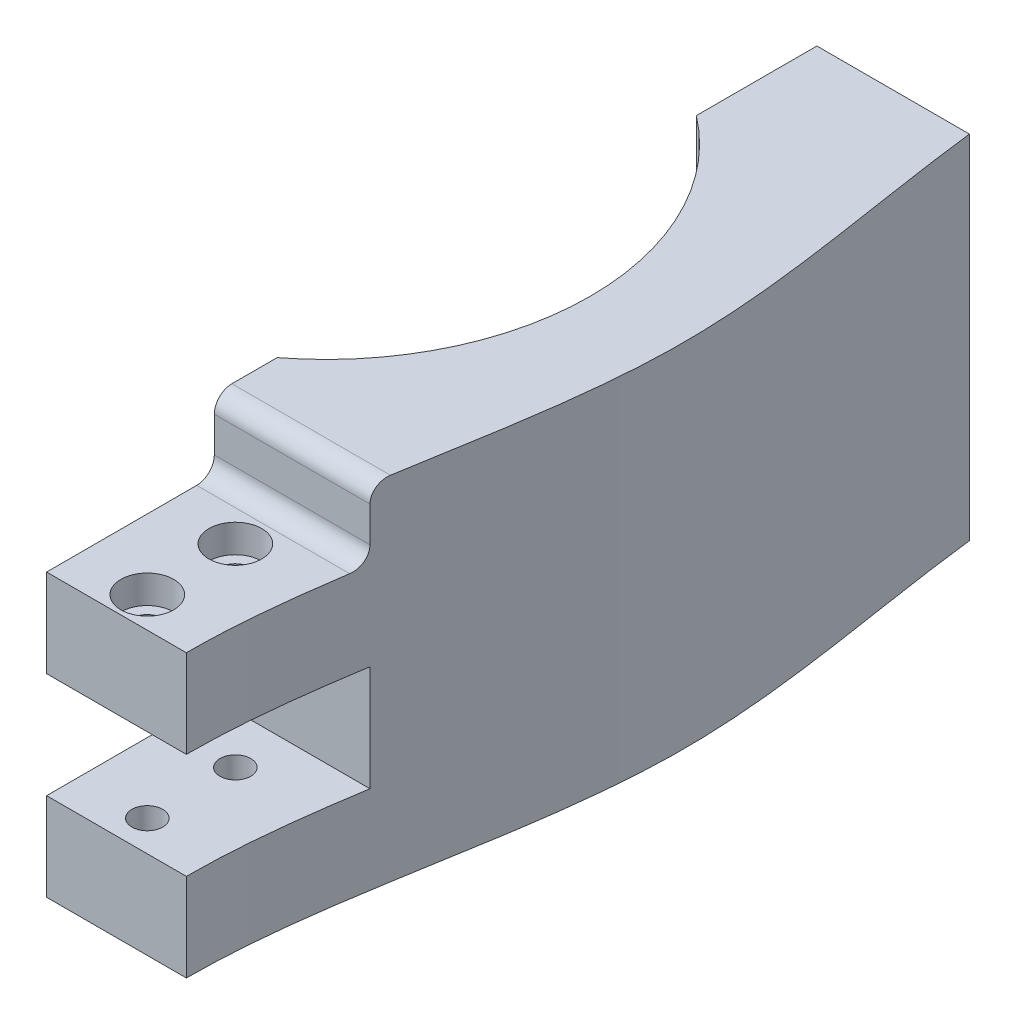
ISO-10303-21;
HEADER;
FILE_DESCRIPTION(('STEP AP214'),'2;1');
FILE_NAME('part.step','',(''),(''),'','','');
FILE_SCHEMA(('AUTOMOTIVE_DESIGN { 1 0 10303 214 1 1 1 1 }'));
ENDSEC;
DATA;
#1=APPLICATION_CONTEXT('core data for automotive mechanical design processes');
#2=APPLICATION_PROTOCOL_DEFINITION('international standard','automotive_design',2000,#1);
#3=PRODUCT_CONTEXT('',#1,'mechanical');
#4=PRODUCT('Part','Part','',(#3));
#5=PRODUCT_RELATED_PRODUCT_CATEGORY('part','',(#4));
#6=PRODUCT_DEFINITION_FORMATION('','',#4);
#7=PRODUCT_DEFINITION_CONTEXT('part definition',#1,'design');
#8=PRODUCT_DEFINITION('design','',#6,#7);
#9=PRODUCT_DEFINITION_SHAPE('','',#8);
#10=(LENGTH_UNIT() NAMED_UNIT(*) SI_UNIT(.MILLI.,.METRE.));
#11=(NAMED_UNIT(*) PLANE_ANGLE_UNIT() SI_UNIT($,.RADIAN.));
#12=(NAMED_UNIT(*) SI_UNIT($,.STERADIAN.) SOLID_ANGLE_UNIT());
#13=UNCERTAINTY_MEASURE_WITH_UNIT(LENGTH_MEASURE(1.E-05),#10,'distance_accuracy_value','');
#14=(GEOMETRIC_REPRESENTATION_CONTEXT(3) GLOBAL_UNCERTAINTY_ASSIGNED_CONTEXT((#13)) GLOBAL_UNIT_ASSIGNED_CONTEXT((#10,
#11,#12)) REPRESENTATION_CONTEXT('',''));
#15=CARTESIAN_POINT('',(0.,0.,0.));
#16=DIRECTION('',(0.,0.,1.));
#17=DIRECTION('',(1.,0.,0.));
#18=AXIS2_PLACEMENT_3D('',#15,#16,#17);
#19=CARTESIAN_POINT('',(26.1874999999999,0.,36.4999999999999));
#20=DIRECTION('',(0.,1.,0.));
#21=DIRECTION('',(0.,0.,1.));
#22=AXIS2_PLACEMENT_3D('',#19,#20,#21);
#23=CYLINDRICAL_SURFACE('',#22,1.75);
#24=CARTESIAN_POINT('',(26.1874999999999,10.,36.4999999999999));
#25=DIRECTION('',(0.,-1.,0.));
#26=DIRECTION('',(1.,0.,0.));
#27=AXIS2_PLACEMENT_3D('',#24,#25,#26);
#28=CIRCLE('',#27,1.75);
#29=CARTESIAN_POINT('',(27.9374999999999,10.,36.4999999999999));
#30=VERTEX_POINT('',#29);
#31=EDGE_CURVE('E411',#30,#30,#28,.F.);
#32=ORIENTED_EDGE('',*,*,#31,.T.);
#33=EDGE_LOOP('',(#32));
#34=FACE_BOUND('',#33,.T.);
#35=CARTESIAN_POINT('',(26.1874999999999,3.2,36.4999999999999));
#36=DIRECTION('',(0.,1.,0.));
#37=DIRECTION('',(0.,0.,-1.));
#38=AXIS2_PLACEMENT_3D('',#35,#36,#37);
#39=CIRCLE('',#38,1.75);
#40=CARTESIAN_POINT('',(26.1874999999999,3.2,34.7499999999999));
#41=VERTEX_POINT('',#40);
#42=EDGE_CURVE('E385',#41,#41,#39,.F.);
#43=ORIENTED_EDGE('',*,*,#42,.T.);
#44=EDGE_LOOP('',(#43));
#45=FACE_BOUND('',#44,.T.);
#46=ADVANCED_FACE('F46',(#34,#45),#23,.F.);
#47=CARTESIAN_POINT('',(26.1874999999999,0.,46.4999999999999));
#48=DIRECTION('',(0.,1.,0.));
#49=DIRECTION('',(0.,0.,1.));
#50=AXIS2_PLACEMENT_3D('',#47,#48,#49);
#51=CYLINDRICAL_SURFACE('',#50,1.75);
#52=CARTESIAN_POINT('',(26.1874999999999,10.,46.4999999999999));
#53=DIRECTION('',(0.,-1.,0.));
#54=DIRECTION('',(1.,0.,0.));
#55=AXIS2_PLACEMENT_3D('',#52,#53,#54);
#56=CIRCLE('',#55,1.75);
#57=CARTESIAN_POINT('',(27.9374999999999,10.,46.4999999999999));
#58=VERTEX_POINT('',#57);
#59=EDGE_CURVE('E408',#58,#58,#56,.F.);
#60=ORIENTED_EDGE('',*,*,#59,.T.);
#61=EDGE_LOOP('',(#60));
#62=FACE_BOUND('',#61,.T.);
#63=CARTESIAN_POINT('',(26.1874999999999,3.2,46.4999999999999));
#64=DIRECTION('',(0.,1.,0.));
#65=DIRECTION('',(0.,0.,-1.));
#66=AXIS2_PLACEMENT_3D('',#63,#64,#65);
#67=CIRCLE('',#66,1.75);
#68=CARTESIAN_POINT('',(26.1874999999999,3.2,44.7499999999999));
#69=VERTEX_POINT('',#68);
#70=EDGE_CURVE('E356',#69,#69,#67,.F.);
#71=ORIENTED_EDGE('',*,*,#70,.T.);
#72=EDGE_LOOP('',(#71));
#73=FACE_BOUND('',#72,.T.);
#74=ADVANCED_FACE('F510',(#62,#73),#51,.F.);
#75=CARTESIAN_POINT('',(26.1874999999999,22.,36.4999999999999));
#76=DIRECTION('',(0.,-1.,0.));
#77=DIRECTION('',(1.,0.,0.));
#78=AXIS2_PLACEMENT_3D('',#75,#76,#77);
#79=CIRCLE('',#78,1.75);
#80=CARTESIAN_POINT('',(27.9374999999999,22.,36.4999999999999));
#81=VERTEX_POINT('',#80);
#82=EDGE_CURVE('E421',#81,#81,#79,.F.);
#83=ORIENTED_EDGE('',*,*,#82,.F.);
#84=EDGE_LOOP('',(#83));
#85=FACE_BOUND('',#84,.T.);
#86=CARTESIAN_POINT('',(26.1874999999999,28.8,36.4999999999999));
#87=DIRECTION('',(0.,-1.,0.));
#88=DIRECTION('',(0.,0.,1.));
#89=AXIS2_PLACEMENT_3D('',#86,#87,#88);
#90=CIRCLE('',#89,1.75);
#91=CARTESIAN_POINT('',(26.1874999999999,28.8,38.2499999999999));
#92=VERTEX_POINT('',#91);
#93=EDGE_CURVE('E401',#92,#92,#90,.F.);
#94=ORIENTED_EDGE('',*,*,#93,.T.);
#95=EDGE_LOOP('',(#94));
#96=FACE_BOUND('',#95,.T.);
#97=ADVANCED_FACE('F513',(#85,#96),#23,.F.);
#98=CARTESIAN_POINT('',(26.1874999999999,22.,46.4999999999999));
#99=DIRECTION('',(0.,-1.,0.));
#100=DIRECTION('',(1.,0.,0.));
#101=AXIS2_PLACEMENT_3D('',#98,#99,#100);
#102=CIRCLE('',#101,1.75);
#103=CARTESIAN_POINT('',(27.9374999999999,22.,46.4999999999999));
#104=VERTEX_POINT('',#103);
#105=EDGE_CURVE('E420',#104,#104,#102,.F.);
#106=ORIENTED_EDGE('',*,*,#105,.F.);
#107=EDGE_LOOP('',(#106));
#108=FACE_BOUND('',#107,.T.);
#109=CARTESIAN_POINT('',(26.1874999999999,28.8,46.4999999999999));
#110=DIRECTION('',(0.,-1.,0.));
#111=DIRECTION('',(0.,0.,1.));
#112=AXIS2_PLACEMENT_3D('',#109,#110,#111);
#113=CIRCLE('',#112,1.75);
#114=CARTESIAN_POINT('',(26.1874999999999,28.8,48.2499999999999));
#115=VERTEX_POINT('',#114);
#116=EDGE_CURVE('E372',#115,#115,#113,.F.);
#117=ORIENTED_EDGE('',*,*,#116,.T.);
#118=EDGE_LOOP('',(#117));
#119=FACE_BOUND('',#118,.T.);
#120=ADVANCED_FACE('F519',(#108,#119),#51,.F.);
#121=CARTESIAN_POINT('',(0.,40.,49.9999999999999));
#122=DIRECTION('',(0.,0.,1.));
#123=DIRECTION('',(-1.,0.,0.));
#124=AXIS2_PLACEMENT_3D('',#121,#122,#123);
#125=PLANE('',#124);
#126=DIRECTION('',(0.,1.,0.));
#127=VECTOR('',#126,1.);
#128=CARTESIAN_POINT('',(18.2499999999999,40.,49.9999999999999));
#129=LINE('',#128,#127);
#130=CARTESIAN_POINT('',(18.2499999999999,0.,49.9999999999999));
#131=VERTEX_POINT('',#130);
#132=CARTESIAN_POINT('',(18.2499999999999,10.,49.9999999999999));
#133=VERTEX_POINT('',#132);
#134=EDGE_CURVE('E230',#131,#133,#129,.T.);
#135=ORIENTED_EDGE('',*,*,#134,.F.);
#136=DIRECTION('',(1.,0.,0.));
#137=VECTOR('',#136,1.);
#138=CARTESIAN_POINT('',(0.,0.,49.9999999999999));
#139=LINE('',#138,#137);
#140=CARTESIAN_POINT('',(34.1249999999999,0.,49.9999999999999));
#141=VERTEX_POINT('',#140);
#142=EDGE_CURVE('E313',#131,#141,#139,.T.);
#143=ORIENTED_EDGE('',*,*,#142,.T.);
#144=DIRECTION('',(0.,1.,0.));
#145=VECTOR('',#144,1.);
#146=CARTESIAN_POINT('',(34.1249999999999,0.,49.9999999999999));
#147=LINE('',#146,#145);
#148=CARTESIAN_POINT('',(34.1249999999999,10.,49.9999999999999));
#149=VERTEX_POINT('',#148);
#150=EDGE_CURVE('E286',#141,#149,#147,.T.);
#151=ORIENTED_EDGE('',*,*,#150,.T.);
#152=DIRECTION('',(1.,0.,0.));
#153=VECTOR('',#152,1.);
#154=CARTESIAN_POINT('',(0.,10.,49.9999999999999));
#155=LINE('',#154,#153);
#156=EDGE_CURVE('E389',#133,#149,#155,.T.);
#157=ORIENTED_EDGE('',*,*,#156,.F.);
#158=EDGE_LOOP('',(#135,#143,#151,#157));
#159=FACE_BOUND('',#158,.T.);
#160=ADVANCED_FACE('F490',(#159),#125,.T.);
#161=DIRECTION('',(1.,0.,0.));
#162=VECTOR('',#161,1.);
#163=CARTESIAN_POINT('',(0.,22.,49.9999999999999));
#164=LINE('',#163,#162);
#165=CARTESIAN_POINT('',(18.2499999999999,22.,49.9999999999999));
#166=VERTEX_POINT('',#165);
#167=CARTESIAN_POINT('',(34.1249999999999,22.,49.9999999999999));
#168=VERTEX_POINT('',#167);
#169=EDGE_CURVE('E397',#166,#168,#164,.T.);
#170=ORIENTED_EDGE('',*,*,#169,.T.);
#171=CARTESIAN_POINT('',(34.1249999999999,32.,49.9999999999999));
#172=VERTEX_POINT('',#171);
#173=EDGE_CURVE('E273',#168,#172,#147,.T.);
#174=ORIENTED_EDGE('',*,*,#173,.T.);
#175=DIRECTION('',(-1.,0.,0.));
#176=VECTOR('',#175,1.);
#177=CARTESIAN_POINT('',(0.,32.,49.9999999999999));
#178=LINE('',#177,#176);
#179=CARTESIAN_POINT('',(18.2499999999999,32.,49.9999999999999));
#180=VERTEX_POINT('',#179);
#181=EDGE_CURVE('E445',#172,#180,#178,.T.);
#182=ORIENTED_EDGE('',*,*,#181,.T.);
#183=EDGE_CURVE('E229',#166,#180,#129,.T.);
#184=ORIENTED_EDGE('',*,*,#183,.F.);
#185=EDGE_LOOP('',(#170,#174,#182,#184));
#186=FACE_BOUND('',#185,.T.);
#187=ADVANCED_FACE('F487',(#186),#125,.T.);
#188=CARTESIAN_POINT('',(0.,40.,0.));
#189=DIRECTION('',(0.,1.,0.));
#190=DIRECTION('',(0.,0.,1.));
#191=AXIS2_PLACEMENT_3D('',#188,#189,#190);
#192=PLANE('',#191);
#193=DIRECTION('',(-1.,0.,0.));
#194=VECTOR('',#193,1.);
#195=CARTESIAN_POINT('',(0.,40.,-37.5));
#196=LINE('',#195,#194);
#197=CARTESIAN_POINT('',(35.5747493225341,40.0000000000003,-37.5));
#198=VERTEX_POINT('',#197);
#199=CARTESIAN_POINT('',(18.2499999999999,40.,-37.5));
#200=VERTEX_POINT('',#199);
#201=EDGE_CURVE('E191',#198,#200,#196,.T.);
#202=ORIENTED_EDGE('',*,*,#201,.T.);
#203=DIRECTION('',(0.,0.,1.));
#204=VECTOR('',#203,1.);
#205=CARTESIAN_POINT('',(18.2499999999999,40.,0.));
#206=LINE('',#205,#204);
#207=CARTESIAN_POINT('',(18.2499999999999,40.,-23.8104493867714));
#208=VERTEX_POINT('',#207);
#209=EDGE_CURVE('E301',#200,#208,#206,.T.);
#210=ORIENTED_EDGE('',*,*,#209,.T.);
#211=CARTESIAN_POINT('',(0.,40.,0.));
#212=DIRECTION('',(0.,-1.,0.));
#213=DIRECTION('',(0.,0.,1.));
#214=AXIS2_PLACEMENT_3D('',#211,#212,#213);
#215=CIRCLE('',#214,30.);
#216=CARTESIAN_POINT('',(18.2499999999999,40.,23.8104493867714));
#217=VERTEX_POINT('',#216);
#218=EDGE_CURVE('E199',#208,#217,#215,.T.);
#219=ORIENTED_EDGE('',*,*,#218,.T.);
#220=DIRECTION('',(0.,0.,-1.));
#221=VECTOR('',#220,1.);
#222=CARTESIAN_POINT('',(18.2499999999999,40.,77.1779999999999));
#223=LINE('',#222,#221);
#224=CARTESIAN_POINT('',(18.2499999999999,40.,28.9499999999999));
#225=VERTEX_POINT('',#224);
#226=EDGE_CURVE('E305',#225,#217,#223,.T.);
#227=ORIENTED_EDGE('',*,*,#226,.F.);
#228=DIRECTION('',(1.,0.,0.));
#229=VECTOR('',#228,1.);
#230=CARTESIAN_POINT('',(18.2499999999999,40.,28.9499999999999));
#231=LINE('',#230,#229);
#232=CARTESIAN_POINT('',(36.2562387666154,40.,28.9499999999962));
#233=VERTEX_POINT('',#232);
#234=EDGE_CURVE('E251',#233,#225,#231,.F.);
#235=ORIENTED_EDGE('',*,*,#234,.F.);
#236=CARTESIAN_POINT('',(34.1249999999999,40.,49.9999999999999));
#237=CARTESIAN_POINT('',(34.125,40.,33.2412292130654));
#238=CARTESIAN_POINT('',(45.2370364850688,40.,0.0937054177962775));
#239=CARTESIAN_POINT('',(34.76,40.,-33.3302161033955));
#240=CARTESIAN_POINT('',(34.76,40.,-50.));
#241=B_SPLINE_CURVE_WITH_KNOTS('',3,(#236,#237,#238,#239,#240),.UNSPECIFIED.,.F.,.F.,(4,1,4),
(0.,0.500369617160001,1.),.UNSPECIFIED.);
#242=EDGE_CURVE('E274',#233,#198,#241,.T.);
#243=ORIENTED_EDGE('',*,*,#242,.T.);
#244=EDGE_LOOP('',(#202,#210,#219,#227,#235,#243));
#245=FACE_BOUND('',#244,.T.);
#246=ADVANCED_FACE('F335',(#245),#192,.T.);
#247=CARTESIAN_POINT('',(0.,0.,0.));
#248=DIRECTION('',(0.,1.,0.));
#249=DIRECTION('',(0.,0.,1.));
#250=AXIS2_PLACEMENT_3D('',#247,#248,#249);
#251=PLANE('',#250);
#252=CARTESIAN_POINT('',(26.1874999999999,0.,36.4999999999999));
#253=DIRECTION('',(0.,-1.,0.));
#254=DIRECTION('',(0.,0.,1.));
#255=AXIS2_PLACEMENT_3D('',#252,#253,#254);
#256=CIRCLE('',#255,3.);
#257=CARTESIAN_POINT('',(26.1874999999999,0.,39.4999999999999));
#258=VERTEX_POINT('',#257);
#259=EDGE_CURVE('E357',#258,#258,#256,.T.);
#260=ORIENTED_EDGE('',*,*,#259,.F.);
#261=EDGE_LOOP('',(#260));
#262=FACE_BOUND('',#261,.T.);
#263=CARTESIAN_POINT('',(26.1874999999999,0.,46.4999999999999));
#264=DIRECTION('',(0.,-1.,0.));
#265=DIRECTION('',(0.,0.,1.));
#266=AXIS2_PLACEMENT_3D('',#263,#264,#265);
#267=CIRCLE('',#266,3.);
#268=CARTESIAN_POINT('',(26.1874999999999,0.,49.4999999999999));
#269=VERTEX_POINT('',#268);
#270=EDGE_CURVE('E182',#269,#269,#267,.T.);
#271=ORIENTED_EDGE('',*,*,#270,.F.);
#272=EDGE_LOOP('',(#271));
#273=FACE_BOUND('',#272,.T.);
#274=CARTESIAN_POINT('',(34.1249999999999,0.,49.9999999999999));
#275=CARTESIAN_POINT('',(34.125,0.,33.2412292130654));
#276=CARTESIAN_POINT('',(45.2370364850688,0.,0.0937054177962775));
#277=CARTESIAN_POINT('',(34.76,0.,-33.3302161033955));
#278=CARTESIAN_POINT('',(34.76,0.,-50.));
#279=B_SPLINE_CURVE_WITH_KNOTS('',3,(#274,#275,#276,#277,#278),.UNSPECIFIED.,.F.,.F.,(4,1,4),
(0.,0.500369617160001,1.),.UNSPECIFIED.);
#280=CARTESIAN_POINT('',(35.5747493225341,0.,-37.4999999999994));
#281=VERTEX_POINT('',#280);
#282=EDGE_CURVE('E266',#141,#281,#279,.T.);
#283=ORIENTED_EDGE('',*,*,#282,.F.);
#284=ORIENTED_EDGE('',*,*,#142,.F.);
#285=DIRECTION('',(0.,0.,-1.));
#286=VECTOR('',#285,1.);
#287=CARTESIAN_POINT('',(18.2499999999999,0.,77.1779999999999));
#288=LINE('',#287,#286);
#289=CARTESIAN_POINT('',(18.2499999999999,0.,23.8104493867714));
#290=VERTEX_POINT('',#289);
#291=EDGE_CURVE('E311',#131,#290,#288,.T.);
#292=ORIENTED_EDGE('',*,*,#291,.T.);
#293=CARTESIAN_POINT('',(0.,0.,0.));
#294=DIRECTION('',(0.,-1.,0.));
#295=DIRECTION('',(0.,0.,1.));
#296=AXIS2_PLACEMENT_3D('',#293,#294,#295);
#297=CIRCLE('',#296,30.);
#298=CARTESIAN_POINT('',(18.2499999999999,0.,-23.8104493867714));
#299=VERTEX_POINT('',#298);
#300=EDGE_CURVE('E196',#299,#290,#297,.T.);
#301=ORIENTED_EDGE('',*,*,#300,.F.);
#302=DIRECTION('',(0.,0.,1.));
#303=VECTOR('',#302,1.);
#304=CARTESIAN_POINT('',(18.2499999999999,0.,0.));
#305=LINE('',#304,#303);
#306=CARTESIAN_POINT('',(18.2499999999999,0.,-37.5));
#307=VERTEX_POINT('',#306);
#308=EDGE_CURVE('E176',#307,#299,#305,.T.);
#309=ORIENTED_EDGE('',*,*,#308,.F.);
#310=DIRECTION('',(1.,0.,0.));
#311=VECTOR('',#310,1.);
#312=CARTESIAN_POINT('',(0.,0.,-37.5));
#313=LINE('',#312,#311);
#314=EDGE_CURVE('E186',#307,#281,#313,.T.);
#315=ORIENTED_EDGE('',*,*,#314,.T.);
#316=EDGE_LOOP('',(#283,#284,#292,#301,#309,#315));
#317=FACE_BOUND('',#316,.T.);
#318=ADVANCED_FACE('F193',(#262,#273,#317),#251,.F.);
#319=CARTESIAN_POINT('',(18.2499999999999,40.,77.1779999999999));
#320=DIRECTION('',(1.,0.,0.));
#321=DIRECTION('',(0.,0.,1.));
#322=AXIS2_PLACEMENT_3D('',#319,#320,#321);
#323=PLANE('',#322);
#324=ORIENTED_EDGE('',*,*,#183,.T.);
#325=DIRECTION('',(0.,0.,-1.));
#326=VECTOR('',#325,1.);
#327=CARTESIAN_POINT('',(18.2499999999999,32.,0.));
#328=LINE('',#327,#326);
#329=CARTESIAN_POINT('',(18.2499999999999,32.,32.9499999999999));
#330=VERTEX_POINT('',#329);
#331=EDGE_CURVE('E433',#180,#330,#328,.T.);
#332=ORIENTED_EDGE('',*,*,#331,.T.);
#333=CARTESIAN_POINT('',(18.2499999999999,34.,32.9499999999999));
#334=DIRECTION('',(-1.,0.,0.));
#335=DIRECTION('',(0.,0.,1.));
#336=AXIS2_PLACEMENT_3D('',#333,#334,#335);
#337=CIRCLE('',#336,2.);
#338=CARTESIAN_POINT('',(18.2499999999999,34.,30.9499999999999));
#339=VERTEX_POINT('',#338);
#340=EDGE_CURVE('E460',#339,#330,#337,.T.);
#341=ORIENTED_EDGE('',*,*,#340,.F.);
#342=DIRECTION('',(0.,1.,0.));
#343=VECTOR('',#342,1.);
#344=CARTESIAN_POINT('',(18.2499999999999,32.,30.9499999999999));
#345=LINE('',#344,#343);
#346=CARTESIAN_POINT('',(18.2499999999999,38.,30.9499999999999));
#347=VERTEX_POINT('',#346);
#348=EDGE_CURVE('E275',#339,#347,#345,.T.);
#349=ORIENTED_EDGE('',*,*,#348,.T.);
#350=CARTESIAN_POINT('',(18.2499999999999,38.,28.9499999999999));
#351=DIRECTION('',(-1.,0.,0.));
#352=DIRECTION('',(0.,0.,1.));
#353=AXIS2_PLACEMENT_3D('',#350,#351,#352);
#354=CIRCLE('',#353,2.);
#355=EDGE_CURVE('E330',#225,#347,#354,.F.);
#356=ORIENTED_EDGE('',*,*,#355,.F.);
#357=ORIENTED_EDGE('',*,*,#226,.T.);
#358=DIRECTION('',(0.,-1.,0.));
#359=VECTOR('',#358,1.);
#360=CARTESIAN_POINT('',(18.2499999999999,40.,23.8104493867714));
#361=LINE('',#360,#359);
#362=EDGE_CURVE('E297',#290,#217,#361,.F.);
#363=ORIENTED_EDGE('',*,*,#362,.F.);
#364=ORIENTED_EDGE('',*,*,#291,.F.);
#365=ORIENTED_EDGE('',*,*,#134,.T.);
#366=DIRECTION('',(0.,0.,1.));
#367=VECTOR('',#366,1.);
#368=CARTESIAN_POINT('',(18.2499999999999,10.,30.9499999999999));
#369=LINE('',#368,#367);
#370=CARTESIAN_POINT('',(18.2499999999999,10.,30.9499999999999));
#371=VERTEX_POINT('',#370);
#372=EDGE_CURVE('E396',#371,#133,#369,.T.);
#373=ORIENTED_EDGE('',*,*,#372,.F.);
#374=DIRECTION('',(0.,1.,0.));
#375=VECTOR('',#374,1.);
#376=CARTESIAN_POINT('',(18.2499999999999,0.,30.9499999999999));
#377=LINE('',#376,#375);
#378=CARTESIAN_POINT('',(18.2499999999999,22.,30.9499999999999));
#379=VERTEX_POINT('',#378);
#380=EDGE_CURVE('E392',#371,#379,#377,.T.);
#381=ORIENTED_EDGE('',*,*,#380,.T.);
#382=DIRECTION('',(0.,0.,1.));
#383=VECTOR('',#382,1.);
#384=CARTESIAN_POINT('',(18.2499999999999,22.,30.9499999999999));
#385=LINE('',#384,#383);
#386=EDGE_CURVE('E405',#379,#166,#385,.T.);
#387=ORIENTED_EDGE('',*,*,#386,.T.);
#388=EDGE_LOOP('',(#324,#332,#341,#349,#356,#357,#363,#364,#365,#373,#381,#387));
#389=FACE_BOUND('',#388,.T.);
#390=ADVANCED_FACE('F325',(#389),#323,.F.);
#391=CARTESIAN_POINT('',(0.,40.,0.));
#392=DIRECTION('',(0.,-1.,0.));
#393=DIRECTION('',(0.,0.,-1.));
#394=AXIS2_PLACEMENT_3D('',#391,#392,#393);
#395=CYLINDRICAL_SURFACE('',#394,30.);
#396=DIRECTION('',(0.,-1.,0.));
#397=VECTOR('',#396,1.);
#398=CARTESIAN_POINT('',(18.2499999999999,40.,-23.8104493867714));
#399=LINE('',#398,#397);
#400=EDGE_CURVE('E300',#208,#299,#399,.T.);
#401=ORIENTED_EDGE('',*,*,#400,.T.);
#402=ORIENTED_EDGE('',*,*,#300,.T.);
#403=ORIENTED_EDGE('',*,*,#362,.T.);
#404=ORIENTED_EDGE('',*,*,#218,.F.);
#405=EDGE_LOOP('',(#401,#402,#403,#404));
#406=FACE_BOUND('',#405,.T.);
#407=ADVANCED_FACE('F321',(#406),#395,.F.);
#408=ORIENTED_EDGE('',*,*,#308,.T.);
#409=ORIENTED_EDGE('',*,*,#400,.F.);
#410=ORIENTED_EDGE('',*,*,#209,.F.);
#411=DIRECTION('',(0.,1.,0.));
#412=VECTOR('',#411,1.);
#413=CARTESIAN_POINT('',(18.2499999999999,40.,-37.5));
#414=LINE('',#413,#412);
#415=CARTESIAN_POINT('',(18.2499999999999,39.0147056782581,-37.5));
#416=VERTEX_POINT('',#415);
#417=EDGE_CURVE('E185',#416,#200,#414,.T.);
#418=ORIENTED_EDGE('',*,*,#417,.F.);
#419=DIRECTION('',(0.,0.,-1.));
#420=VECTOR('',#419,1.);
#421=CARTESIAN_POINT('',(18.2499999999999,39.0147056782581,77.1779999999999));
#422=LINE('',#421,#420);
#423=CARTESIAN_POINT('',(18.2499999999999,39.0147056782581,-30.));
#424=VERTEX_POINT('',#423);
#425=EDGE_CURVE('E203',#424,#416,#422,.T.);
#426=ORIENTED_EDGE('',*,*,#425,.F.);
#427=DIRECTION('',(0.,-1.,0.));
#428=VECTOR('',#427,1.);
#429=CARTESIAN_POINT('',(18.2499999999999,40.,-30.));
#430=LINE('',#429,#428);
#431=CARTESIAN_POINT('',(18.2499999999999,5.28520104271268,-30.));
#432=VERTEX_POINT('',#431);
#433=EDGE_CURVE('E198',#424,#432,#430,.T.);
#434=ORIENTED_EDGE('',*,*,#433,.T.);
#435=DIRECTION('',(0.,0.,-1.));
#436=VECTOR('',#435,1.);
#437=CARTESIAN_POINT('',(18.2499999999999,5.28520104271268,77.1779999999999));
#438=LINE('',#437,#436);
#439=CARTESIAN_POINT('',(18.25,5.28520104271268,-37.5));
#440=VERTEX_POINT('',#439);
#441=EDGE_CURVE('E180',#440,#432,#438,.F.);
#442=ORIENTED_EDGE('',*,*,#441,.F.);
#443=EDGE_CURVE('E173',#307,#440,#414,.T.);
#444=ORIENTED_EDGE('',*,*,#443,.F.);
#445=EDGE_LOOP('',(#408,#409,#410,#418,#426,#434,#442,#444));
#446=FACE_BOUND('',#445,.T.);
#447=ADVANCED_FACE('F174',(#446),#323,.F.);
#448=CARTESIAN_POINT('',(5.52969395512682,22.1499533604854,-30.));
#449=DIRECTION('',(0.,0.,-1.));
#450=DIRECTION('',(1.,0.,0.));
#451=AXIS2_PLACEMENT_3D('',#448,#449,#450);
#452=CYLINDRICAL_SURFACE('',#451,20.);
#453=DIRECTION('',(0.,0.,-1.));
#454=VECTOR('',#453,1.);
#455=CARTESIAN_POINT('',(19.2473259248124,7.59569030307636,-30.));
#456=LINE('',#455,#454);
#457=CARTESIAN_POINT('',(19.2473259248124,7.59569030307637,-30.));
#458=VERTEX_POINT('',#457);
#459=CARTESIAN_POINT('',(19.2473259248124,7.59569030307637,-37.5));
#460=VERTEX_POINT('',#459);
#461=EDGE_CURVE('E219',#458,#460,#456,.T.);
#462=ORIENTED_EDGE('',*,*,#461,.F.);
#463=CARTESIAN_POINT('',(5.52969395512682,22.1499533604854,-30.));
#464=DIRECTION('',(0.,0.,1.));
#465=DIRECTION('',(1.,0.,0.));
#466=AXIS2_PLACEMENT_3D('',#463,#464,#465);
#467=CIRCLE('',#466,20.);
#468=CARTESIAN_POINT('',(19.2473259248124,36.7042164178945,-30.));
#469=VERTEX_POINT('',#468);
#470=EDGE_CURVE('E293',#458,#469,#467,.T.);
#471=ORIENTED_EDGE('',*,*,#470,.T.);
#472=DIRECTION('',(0.,0.,-1.));
#473=VECTOR('',#472,1.);
#474=CARTESIAN_POINT('',(19.2473259248124,36.7042164178945,-30.));
#475=LINE('',#474,#473);
#476=CARTESIAN_POINT('',(19.2473259248124,36.7042164178945,-37.5));
#477=VERTEX_POINT('',#476);
#478=EDGE_CURVE('E215',#477,#469,#475,.F.);
#479=ORIENTED_EDGE('',*,*,#478,.F.);
#480=CARTESIAN_POINT('',(5.52969395512683,22.1499533604854,-37.5));
#481=DIRECTION('',(0.,0.,-1.));
#482=DIRECTION('',(-1.,0.,0.));
#483=AXIS2_PLACEMENT_3D('',#480,#481,#482);
#484=CIRCLE('',#483,20.);
#485=EDGE_CURVE('E343',#460,#477,#484,.F.);
#486=ORIENTED_EDGE('',*,*,#485,.F.);
#487=EDGE_LOOP('',(#462,#471,#479,#486));
#488=FACE_BOUND('',#487,.T.);
#489=ADVANCED_FACE('F500',(#488),#452,.F.);
#490=CARTESIAN_POINT('',(5.52969395512682,22.1499533604854,-30.));
#491=DIRECTION('',(0.,0.,-1.));
#492=DIRECTION('',(1.,0.,0.));
#493=AXIS2_PLACEMENT_3D('',#490,#491,#492);
#494=PLANE('',#493);
#495=ORIENTED_EDGE('',*,*,#433,.F.);
#496=CARTESIAN_POINT('',(21.4249999999999,39.0147056782581,-30.));
#497=DIRECTION('',(0.,0.,1.));
#498=DIRECTION('',(1.,0.,0.));
#499=AXIS2_PLACEMENT_3D('',#496,#497,#498);
#500=CIRCLE('',#499,3.175);
#501=EDGE_CURVE('E226',#469,#424,#500,.F.);
#502=ORIENTED_EDGE('',*,*,#501,.F.);
#503=ORIENTED_EDGE('',*,*,#470,.F.);
#504=CARTESIAN_POINT('',(21.4249999999999,5.28520104271268,-30.));
#505=DIRECTION('',(0.,0.,1.));
#506=DIRECTION('',(1.,0.,0.));
#507=AXIS2_PLACEMENT_3D('',#504,#505,#506);
#508=CIRCLE('',#507,3.175);
#509=EDGE_CURVE('E223',#432,#458,#508,.F.);
#510=ORIENTED_EDGE('',*,*,#509,.F.);
#511=EDGE_LOOP('',(#495,#502,#503,#510));
#512=FACE_BOUND('',#511,.T.);
#513=ADVANCED_FACE('F263',(#512),#494,.T.);
#514=CARTESIAN_POINT('',(21.4249999999999,5.28520104271268,-30.));
#515=DIRECTION('',(0.,0.,-1.));
#516=DIRECTION('',(1.,0.,0.));
#517=AXIS2_PLACEMENT_3D('',#514,#515,#516);
#518=CYLINDRICAL_SURFACE('',#517,3.175);
#519=CARTESIAN_POINT('',(21.425,5.28520104271268,-37.5));
#520=DIRECTION('',(0.,0.,-1.));
#521=DIRECTION('',(-1.,0.,0.));
#522=AXIS2_PLACEMENT_3D('',#519,#520,#521);
#523=CIRCLE('',#522,3.175);
#524=EDGE_CURVE('E183',#460,#440,#523,.F.);
#525=ORIENTED_EDGE('',*,*,#524,.T.);
#526=ORIENTED_EDGE('',*,*,#441,.T.);
#527=ORIENTED_EDGE('',*,*,#509,.T.);
#528=ORIENTED_EDGE('',*,*,#461,.T.);
#529=EDGE_LOOP('',(#525,#526,#527,#528));
#530=FACE_BOUND('',#529,.T.);
#531=ADVANCED_FACE('F482',(#530),#518,.T.);
#532=CARTESIAN_POINT('',(21.4249999999999,39.0147056782581,-30.));
#533=DIRECTION('',(0.,0.,-1.));
#534=DIRECTION('',(1.,0.,0.));
#535=AXIS2_PLACEMENT_3D('',#532,#533,#534);
#536=CYLINDRICAL_SURFACE('',#535,3.175);
#537=CARTESIAN_POINT('',(21.425,39.0147056782581,-37.5));
#538=DIRECTION('',(0.,0.,-1.));
#539=DIRECTION('',(-1.,0.,0.));
#540=AXIS2_PLACEMENT_3D('',#537,#538,#539);
#541=CIRCLE('',#540,3.175);
#542=EDGE_CURVE('E340',#416,#477,#541,.F.);
#543=ORIENTED_EDGE('',*,*,#542,.T.);
#544=ORIENTED_EDGE('',*,*,#478,.T.);
#545=ORIENTED_EDGE('',*,*,#501,.T.);
#546=ORIENTED_EDGE('',*,*,#425,.T.);
#547=EDGE_LOOP('',(#543,#544,#545,#546));
#548=FACE_BOUND('',#547,.T.);
#549=ADVANCED_FACE('F260',(#548),#536,.T.);
#550=DIRECTION('',(0.,1.,0.));
#551=VECTOR('',#550,1.);
#552=SURFACE_OF_LINEAR_EXTRUSION('',#279,#551);
#553=ORIENTED_EDGE('',*,*,#242,.F.);
#554=CARTESIAN_POINT('',(35.932995014836,38.,30.9499999999999));
#555=CARTESIAN_POINT('',(35.9329951051663,38.0557591105581,30.9499999933102));
#556=CARTESIAN_POINT('',(35.9333650671925,38.1114913377082,30.9476666967746));
#557=CARTESIAN_POINT('',(35.9348411874909,38.2225532176036,30.9383606782756));
#558=CARTESIAN_POINT('',(35.9359472929313,38.277882898951,30.9313882892533));
#559=CARTESIAN_POINT('',(35.9403587356898,38.4425387197639,30.9035895597447));
#560=CARTESIAN_POINT('',(35.9447572335479,38.5507558376649,30.8758814060493));
#561=CARTESIAN_POINT('',(35.9563530950685,38.7609311769614,30.8029381438029));
#562=CARTESIAN_POINT('',(35.9635514774603,38.8628871045903,30.7576966558247));
#563=CARTESIAN_POINT('',(35.980553178592,39.0577201666143,30.6510449577735));
#564=CARTESIAN_POINT('',(35.9903562866998,39.1505980342799,30.589636055088));
#565=CARTESIAN_POINT('',(36.0123629766337,39.3251919850595,30.4520934296103));
#566=CARTESIAN_POINT('',(36.0245789344822,39.4068466777794,30.3758838260839));
#567=CARTESIAN_POINT('',(36.0510524843546,39.5562378030544,30.2111461997328));
#568=CARTESIAN_POINT('',(36.0653105127108,39.6239712534861,30.1226155443653));
#569=CARTESIAN_POINT('',(36.0956638268484,39.7444422860585,29.9346494076827));
#570=CARTESIAN_POINT('',(36.1117790047775,39.7969912947197,29.835096414649));
#571=CARTESIAN_POINT('',(36.1452656914243,39.884618189958,29.6287934827336));
#572=CARTESIAN_POINT('',(36.162636698174,39.9197030134172,29.5220464205408));
#573=CARTESIAN_POINT('',(36.1927747094254,39.9636880705607,29.3373332558278));
#574=CARTESIAN_POINT('',(36.2053460932437,39.9772976319358,29.2604215141398));
#575=CARTESIAN_POINT('',(36.2306826548123,39.9954530598638,29.1056813986967));
#576=CARTESIAN_POINT('',(36.2434475305641,40.0000118268987,29.0278544888758));
#577=CARTESIAN_POINT('',(36.2562387666154,40.,28.9499999999966));
#578=B_SPLINE_CURVE_WITH_KNOTS('',3,(#554,#555,#556,#557,#558,#559,#560,#561,#562,#563,#564,
#565,#566,#567,#568,#569,#570,#571,#572,#573,#574,#575,#576,#577),.UNSPECIFIED.,.F.,.F.,(4,2,2,
2,2,2,2,2,2,2,2,4),(0.,0.167173998286083,0.334336000026613,0.667996007696204,1.00177753025189,
1.33553206965202,1.67104517388333,2.00663007494688,2.34621916272722,2.6856732557755,
2.92251290448186,3.15901473251893),.UNSPECIFIED.);
#579=CARTESIAN_POINT('',(35.932995014836,38.,30.9499999932036));
#580=VERTEX_POINT('',#579);
#581=EDGE_CURVE('E243',#580,#233,#578,.T.);
#582=ORIENTED_EDGE('',*,*,#581,.F.);
#583=DIRECTION('',(0.,1.,0.));
#584=VECTOR('',#583,1.);
#585=CARTESIAN_POINT('',(35.932995014836,32.,30.9499999932036));
#586=LINE('',#585,#584);
#587=CARTESIAN_POINT('',(35.932995014836,34.,30.9499999932036));
#588=VERTEX_POINT('',#587);
#589=EDGE_CURVE('E285',#588,#580,#586,.T.);
#590=ORIENTED_EDGE('',*,*,#589,.F.);
#591=CARTESIAN_POINT('',(35.6232418369624,32.,32.9499999999999));
#592=CARTESIAN_POINT('',(35.6318043458482,32.000000729518,32.8932195359609));
#593=CARTESIAN_POINT('',(35.6403839322921,32.0024194927997,32.8364694353144));
#594=CARTESIAN_POINT('',(35.6575225610865,32.012069663563,32.7233786647547));
#595=CARTESIAN_POINT('',(35.6660816040585,32.0193009235861,32.66703798235));
#596=CARTESIAN_POINT('',(35.6916237847587,32.0481526943171,32.4992981131828));
#597=CARTESIAN_POINT('',(35.7084952555149,32.0769313402813,32.3890267960342));
#598=CARTESIAN_POINT('',(35.7414027565789,32.1528231271435,32.1748412314399));
#599=CARTESIAN_POINT('',(35.7574383079758,32.1999466499947,32.0709306223263));
#600=CARTESIAN_POINT('',(35.7881744772102,32.3112495853534,31.8724783889515));
#601=CARTESIAN_POINT('',(35.8028754374415,32.3754246065566,31.777934361091));
#602=CARTESIAN_POINT('',(35.8304078629634,32.5187338829173,31.6014012884656));
#603=CARTESIAN_POINT('',(35.8432478172394,32.597796168371,31.5193551411217));
#604=CARTESIAN_POINT('',(35.8667221023441,32.7689020327556,31.3697111773109));
#605=CARTESIAN_POINT('',(35.8773560634715,32.8609477832429,31.3021157825798));
#606=CARTESIAN_POINT('',(35.8959516663795,33.054301269865,31.1841157867651));
#607=CARTESIAN_POINT('',(35.9039413464084,33.155496313096,31.1335307203845));
#608=CARTESIAN_POINT('',(35.9171316151342,33.3650885822081,31.0501093698453));
#609=CARTESIAN_POINT('',(35.9223343285309,33.4734802505345,31.0172595647035));
#610=CARTESIAN_POINT('',(35.9283607282522,33.6522160769337,30.9792267975182));
#611=CARTESIAN_POINT('',(35.9300972820491,33.721355118626,30.9682732541669));
#612=CARTESIAN_POINT('',(35.9324142977298,33.8603188984996,30.9536614660808));
#613=CARTESIAN_POINT('',(35.9329964063111,33.930142517026,30.9499928301645));
#614=CARTESIAN_POINT('',(35.9329950137581,34.0000000000363,30.9499999999999));
#615=B_SPLINE_CURVE_WITH_KNOTS('',3,(#591,#592,#593,#594,#595,#596,#597,#598,#599,#600,#601,
#602,#603,#604,#605,#606,#607,#608,#609,#610,#611,#612,#613,#614),.UNSPECIFIED.,.F.,.F.,(4,2,2,
2,2,2,2,2,2,2,2,4),(0.,0.172161818489851,0.344318362056375,0.688169217203694,1.03221495211326,
1.37617217001221,1.71850740363966,2.06089996277653,2.39953610974256,2.73791372188889,
2.9476207765166,3.15702848981472),.UNSPECIFIED.);
#616=CARTESIAN_POINT('',(35.6232418369479,32.,32.9499999999975));
#617=VERTEX_POINT('',#616);
#618=EDGE_CURVE('E464',#617,#588,#615,.T.);
#619=ORIENTED_EDGE('',*,*,#618,.F.);
#620=CARTESIAN_POINT('',(34.76,32.,-50.));
#621=CARTESIAN_POINT('',(34.76,32.,-33.3302161033955));
#622=CARTESIAN_POINT('',(45.2370364850688,32.,0.0937054177962775));
#623=CARTESIAN_POINT('',(34.125,32.,33.2412292130654));
#624=CARTESIAN_POINT('',(34.1249999999999,32.,49.9999999999999));
#625=B_SPLINE_CURVE_WITH_KNOTS('',3,(#620,#621,#622,#623,#624),.UNSPECIFIED.,.F.,.F.,(4,1,4),
(0.,0.499630382839999,1.),.UNSPECIFIED.);
#626=EDGE_CURVE('E440',#617,#172,#625,.T.);
#627=ORIENTED_EDGE('',*,*,#626,.T.);
#628=ORIENTED_EDGE('',*,*,#173,.F.);
#629=CARTESIAN_POINT('',(34.1249999999999,22.,49.9999999999999));
#630=CARTESIAN_POINT('',(34.125,22.,33.2412292130654));
#631=CARTESIAN_POINT('',(45.2370364850688,22.,0.0937054177962775));
#632=CARTESIAN_POINT('',(34.76,22.,-33.3302161033955));
#633=CARTESIAN_POINT('',(34.76,22.,-50.));
#634=B_SPLINE_CURVE_WITH_KNOTS('',3,(#629,#630,#631,#632,#633),.UNSPECIFIED.,.F.,.F.,(4,1,4),
(0.,0.500369617160001,1.),.UNSPECIFIED.);
#635=CARTESIAN_POINT('',(35.9329950137581,22.,30.9499999999999));
#636=VERTEX_POINT('',#635);
#637=EDGE_CURVE('E428',#636,#168,#634,.F.);
#638=ORIENTED_EDGE('',*,*,#637,.F.);
#639=DIRECTION('',(0.,1.,0.));
#640=VECTOR('',#639,1.);
#641=CARTESIAN_POINT('',(35.9329950137581,0.,30.9499999999999));
#642=LINE('',#641,#640);
#643=CARTESIAN_POINT('',(35.9329950137581,10.,30.9499999999999));
#644=VERTEX_POINT('',#643);
#645=EDGE_CURVE('E56',#636,#644,#642,.F.);
#646=ORIENTED_EDGE('',*,*,#645,.T.);
#647=CARTESIAN_POINT('',(34.1249999999999,10.,49.9999999999999));
#648=CARTESIAN_POINT('',(34.125,10.,33.2412292130654));
#649=CARTESIAN_POINT('',(45.2370364850688,10.,0.0937054177962775));
#650=CARTESIAN_POINT('',(34.76,10.,-33.3302161033955));
#651=CARTESIAN_POINT('',(34.76,10.,-50.));
#652=B_SPLINE_CURVE_WITH_KNOTS('',3,(#647,#648,#649,#650,#651),.UNSPECIFIED.,.F.,.F.,(4,1,4),
(0.,0.500369617160001,1.),.UNSPECIFIED.);
#653=EDGE_CURVE('E415',#644,#149,#652,.F.);
#654=ORIENTED_EDGE('',*,*,#653,.T.);
#655=ORIENTED_EDGE('',*,*,#150,.F.);
#656=ORIENTED_EDGE('',*,*,#282,.T.);
#657=DIRECTION('',(0.,1.,0.));
#658=VECTOR('',#657,1.);
#659=CARTESIAN_POINT('',(35.5747493225341,0.,-37.5));
#660=LINE('',#659,#658);
#661=EDGE_CURVE('E12',#198,#281,#660,.F.);
#662=ORIENTED_EDGE('',*,*,#661,.F.);
#663=EDGE_LOOP('',(#553,#582,#590,#619,#627,#628,#638,#646,#654,#655,#656,#662));
#664=FACE_BOUND('',#663,.T.);
#665=ADVANCED_FACE('F253',(#664),#552,.T.);
#666=CARTESIAN_POINT('',(0.,32.,30.9499999999999));
#667=DIRECTION('',(0.,0.,-1.));
#668=DIRECTION('',(1.,0.,0.));
#669=AXIS2_PLACEMENT_3D('',#666,#667,#668);
#670=PLANE('',#669);
#671=ORIENTED_EDGE('',*,*,#589,.T.);
#672=DIRECTION('',(1.,0.,0.));
#673=VECTOR('',#672,1.);
#674=CARTESIAN_POINT('',(35.932995014836,38.,30.9499999999999));
#675=LINE('',#674,#673);
#676=EDGE_CURVE('E237',#347,#580,#675,.T.);
#677=ORIENTED_EDGE('',*,*,#676,.F.);
#678=ORIENTED_EDGE('',*,*,#348,.F.);
#679=DIRECTION('',(1.,0.,0.));
#680=VECTOR('',#679,1.);
#681=CARTESIAN_POINT('',(0.,34.,30.9499999999999));
#682=LINE('',#681,#680);
#683=EDGE_CURVE('E240',#588,#339,#682,.F.);
#684=ORIENTED_EDGE('',*,*,#683,.F.);
#685=EDGE_LOOP('',(#671,#677,#678,#684));
#686=FACE_BOUND('',#685,.T.);
#687=ADVANCED_FACE('F259',(#686),#670,.F.);
#688=CARTESIAN_POINT('',(0.,32.,0.));
#689=DIRECTION('',(0.,1.,0.));
#690=DIRECTION('',(0.,0.,1.));
#691=AXIS2_PLACEMENT_3D('',#688,#689,#690);
#692=PLANE('',#691);
#693=CARTESIAN_POINT('',(26.1874999999999,32.,36.4999999999999));
#694=DIRECTION('',(0.,-1.,0.));
#695=DIRECTION('',(0.,0.,1.));
#696=AXIS2_PLACEMENT_3D('',#693,#694,#695);
#697=CIRCLE('',#696,3.);
#698=CARTESIAN_POINT('',(26.1874999999999,32.,39.4999999999999));
#699=VERTEX_POINT('',#698);
#700=EDGE_CURVE('E373',#699,#699,#697,.T.);
#701=ORIENTED_EDGE('',*,*,#700,.T.);
#702=EDGE_LOOP('',(#701));
#703=FACE_BOUND('',#702,.T.);
#704=CARTESIAN_POINT('',(26.1874999999999,32.,46.4999999999999));
#705=DIRECTION('',(0.,-1.,0.));
#706=DIRECTION('',(0.,0.,1.));
#707=AXIS2_PLACEMENT_3D('',#704,#705,#706);
#708=CIRCLE('',#707,3.);
#709=CARTESIAN_POINT('',(26.1874999999999,32.,49.4999999999999));
#710=VERTEX_POINT('',#709);
#711=EDGE_CURVE('E381',#710,#710,#708,.T.);
#712=ORIENTED_EDGE('',*,*,#711,.T.);
#713=EDGE_LOOP('',(#712));
#714=FACE_BOUND('',#713,.T.);
#715=ORIENTED_EDGE('',*,*,#331,.F.);
#716=ORIENTED_EDGE('',*,*,#181,.F.);
#717=ORIENTED_EDGE('',*,*,#626,.F.);
#718=DIRECTION('',(1.,0.,0.));
#719=VECTOR('',#718,1.);
#720=CARTESIAN_POINT('',(0.,32.,32.95));
#721=LINE('',#720,#719);
#722=EDGE_CURVE('E234',#330,#617,#721,.T.);
#723=ORIENTED_EDGE('',*,*,#722,.F.);
#724=EDGE_LOOP('',(#715,#716,#717,#723));
#725=FACE_BOUND('',#724,.T.);
#726=ADVANCED_FACE('F478',(#703,#714,#725),#692,.T.);
#727=CARTESIAN_POINT('',(0.,34.,32.95));
#728=DIRECTION('',(1.,0.,0.));
#729=DIRECTION('',(0.,0.,1.));
#730=AXIS2_PLACEMENT_3D('',#727,#728,#729);
#731=CYLINDRICAL_SURFACE('',#730,2.);
#732=ORIENTED_EDGE('',*,*,#340,.T.);
#733=ORIENTED_EDGE('',*,*,#722,.T.);
#734=ORIENTED_EDGE('',*,*,#618,.T.);
#735=ORIENTED_EDGE('',*,*,#683,.T.);
#736=EDGE_LOOP('',(#732,#733,#734,#735));
#737=FACE_BOUND('',#736,.T.);
#738=ADVANCED_FACE('F474',(#737),#731,.F.);
#739=CARTESIAN_POINT('',(0.,38.,28.9499999999999));
#740=DIRECTION('',(-1.,0.,0.));
#741=DIRECTION('',(0.,0.,-1.));
#742=AXIS2_PLACEMENT_3D('',#739,#740,#741);
#743=CYLINDRICAL_SURFACE('',#742,2.);
#744=ORIENTED_EDGE('',*,*,#355,.T.);
#745=ORIENTED_EDGE('',*,*,#676,.T.);
#746=ORIENTED_EDGE('',*,*,#581,.T.);
#747=ORIENTED_EDGE('',*,*,#234,.T.);
#748=EDGE_LOOP('',(#744,#745,#746,#747));
#749=FACE_BOUND('',#748,.T.);
#750=ADVANCED_FACE('F48',(#749),#743,.T.);
#751=CARTESIAN_POINT('',(0.,0.,30.9499999999999));
#752=DIRECTION('',(0.,0.,1.));
#753=DIRECTION('',(-1.,0.,0.));
#754=AXIS2_PLACEMENT_3D('',#751,#752,#753);
#755=PLANE('',#754);
#756=ORIENTED_EDGE('',*,*,#645,.F.);
#757=DIRECTION('',(1.,0.,0.));
#758=VECTOR('',#757,1.);
#759=CARTESIAN_POINT('',(0.,22.,30.9499999999999));
#760=LINE('',#759,#758);
#761=EDGE_CURVE('E69',#379,#636,#760,.T.);
#762=ORIENTED_EDGE('',*,*,#761,.F.);
#763=ORIENTED_EDGE('',*,*,#380,.F.);
#764=DIRECTION('',(1.,0.,0.));
#765=VECTOR('',#764,1.);
#766=CARTESIAN_POINT('',(0.,10.,30.9499999999999));
#767=LINE('',#766,#765);
#768=EDGE_CURVE('E388',#371,#644,#767,.T.);
#769=ORIENTED_EDGE('',*,*,#768,.T.);
#770=EDGE_LOOP('',(#756,#762,#763,#769));
#771=FACE_BOUND('',#770,.T.);
#772=ADVANCED_FACE('F582',(#771),#755,.T.);
#773=CARTESIAN_POINT('',(0.,22.,30.9499999999999));
#774=DIRECTION('',(0.,1.,0.));
#775=DIRECTION('',(1.,0.,0.));
#776=AXIS2_PLACEMENT_3D('',#773,#774,#775);
#777=PLANE('',#776);
#778=ORIENTED_EDGE('',*,*,#105,.T.);
#779=EDGE_LOOP('',(#778));
#780=FACE_BOUND('',#779,.T.);
#781=ORIENTED_EDGE('',*,*,#82,.T.);
#782=EDGE_LOOP('',(#781));
#783=FACE_BOUND('',#782,.T.);
#784=ORIENTED_EDGE('',*,*,#761,.T.);
#785=ORIENTED_EDGE('',*,*,#637,.T.);
#786=ORIENTED_EDGE('',*,*,#169,.F.);
#787=ORIENTED_EDGE('',*,*,#386,.F.);
#788=EDGE_LOOP('',(#784,#785,#786,#787));
#789=FACE_BOUND('',#788,.T.);
#790=ADVANCED_FACE('F585',(#780,#783,#789),#777,.F.);
#791=CARTESIAN_POINT('',(0.,10.,30.9499999999999));
#792=DIRECTION('',(0.,1.,0.));
#793=DIRECTION('',(1.,0.,0.));
#794=AXIS2_PLACEMENT_3D('',#791,#792,#793);
#795=PLANE('',#794);
#796=ORIENTED_EDGE('',*,*,#31,.F.);
#797=EDGE_LOOP('',(#796));
#798=FACE_BOUND('',#797,.T.);
#799=ORIENTED_EDGE('',*,*,#59,.F.);
#800=EDGE_LOOP('',(#799));
#801=FACE_BOUND('',#800,.T.);
#802=ORIENTED_EDGE('',*,*,#653,.F.);
#803=ORIENTED_EDGE('',*,*,#768,.F.);
#804=ORIENTED_EDGE('',*,*,#372,.T.);
#805=ORIENTED_EDGE('',*,*,#156,.T.);
#806=EDGE_LOOP('',(#802,#803,#804,#805));
#807=FACE_BOUND('',#806,.T.);
#808=ADVANCED_FACE('F577',(#798,#801,#807),#795,.T.);
#809=CARTESIAN_POINT('',(26.1874999999999,28.8,46.4999999999999));
#810=DIRECTION('',(0.,1.,0.));
#811=DIRECTION('',(0.,0.,1.));
#812=AXIS2_PLACEMENT_3D('',#809,#810,#811);
#813=PLANE('',#812);
#814=CARTESIAN_POINT('',(26.1874999999999,28.8,46.4999999999999));
#815=DIRECTION('',(0.,-1.,0.));
#816=DIRECTION('',(0.,0.,1.));
#817=AXIS2_PLACEMENT_3D('',#814,#815,#816);
#818=CIRCLE('',#817,3.);
#819=CARTESIAN_POINT('',(26.1874999999999,28.8,49.4999999999999));
#820=VERTEX_POINT('',#819);
#821=EDGE_CURVE('E377',#820,#820,#818,.T.);
#822=ORIENTED_EDGE('',*,*,#821,.F.);
#823=EDGE_LOOP('',(#822));
#824=FACE_BOUND('',#823,.T.);
#825=ORIENTED_EDGE('',*,*,#116,.F.);
#826=EDGE_LOOP('',(#825));
#827=FACE_BOUND('',#826,.T.);
#828=ADVANCED_FACE('F574',(#824,#827),#813,.T.);
#829=CARTESIAN_POINT('',(26.1874999999999,28.8,46.4999999999999));
#830=DIRECTION('',(0.,1.,0.));
#831=DIRECTION('',(0.,0.,1.));
#832=AXIS2_PLACEMENT_3D('',#829,#830,#831);
#833=CYLINDRICAL_SURFACE('',#832,3.);
#834=ORIENTED_EDGE('',*,*,#821,.T.);
#835=EDGE_LOOP('',(#834));
#836=FACE_BOUND('',#835,.T.);
#837=ORIENTED_EDGE('',*,*,#711,.F.);
#838=EDGE_LOOP('',(#837));
#839=FACE_BOUND('',#838,.T.);
#840=ADVANCED_FACE('F569',(#836,#839),#833,.F.);
#841=CARTESIAN_POINT('',(26.1874999999999,28.8,36.4999999999999));
#842=DIRECTION('',(0.,1.,0.));
#843=DIRECTION('',(0.,0.,1.));
#844=AXIS2_PLACEMENT_3D('',#841,#842,#843);
#845=PLANE('',#844);
#846=CARTESIAN_POINT('',(26.1874999999999,28.8,36.4999999999999));
#847=DIRECTION('',(0.,-1.,0.));
#848=DIRECTION('',(0.,0.,1.));
#849=AXIS2_PLACEMENT_3D('',#846,#847,#848);
#850=CIRCLE('',#849,3.);
#851=CARTESIAN_POINT('',(26.1874999999999,28.8,39.4999999999999));
#852=VERTEX_POINT('',#851);
#853=EDGE_CURVE('E368',#852,#852,#850,.T.);
#854=ORIENTED_EDGE('',*,*,#853,.F.);
#855=EDGE_LOOP('',(#854));
#856=FACE_BOUND('',#855,.T.);
#857=ORIENTED_EDGE('',*,*,#93,.F.);
#858=EDGE_LOOP('',(#857));
#859=FACE_BOUND('',#858,.T.);
#860=ADVANCED_FACE('F566',(#856,#859),#845,.T.);
#861=CARTESIAN_POINT('',(26.1874999999999,28.8,36.4999999999999));
#862=DIRECTION('',(0.,1.,0.));
#863=DIRECTION('',(0.,0.,1.));
#864=AXIS2_PLACEMENT_3D('',#861,#862,#863);
#865=CYLINDRICAL_SURFACE('',#864,3.);
#866=ORIENTED_EDGE('',*,*,#853,.T.);
#867=EDGE_LOOP('',(#866));
#868=FACE_BOUND('',#867,.T.);
#869=ORIENTED_EDGE('',*,*,#700,.F.);
#870=EDGE_LOOP('',(#869));
#871=FACE_BOUND('',#870,.T.);
#872=ADVANCED_FACE('F563',(#868,#871),#865,.F.);
#873=CARTESIAN_POINT('',(26.1874999999999,3.2,46.4999999999999));
#874=DIRECTION('',(0.,-1.,0.));
#875=DIRECTION('',(0.,0.,1.));
#876=AXIS2_PLACEMENT_3D('',#873,#874,#875);
#877=PLANE('',#876);
#878=CARTESIAN_POINT('',(26.1874999999999,3.2,46.4999999999999));
#879=DIRECTION('',(0.,-1.,0.));
#880=DIRECTION('',(0.,0.,1.));
#881=AXIS2_PLACEMENT_3D('',#878,#879,#880);
#882=CIRCLE('',#881,3.);
#883=CARTESIAN_POINT('',(26.1874999999999,3.2,49.4999999999999));
#884=VERTEX_POINT('',#883);
#885=EDGE_CURVE('E361',#884,#884,#882,.T.);
#886=ORIENTED_EDGE('',*,*,#885,.T.);
#887=EDGE_LOOP('',(#886));
#888=FACE_BOUND('',#887,.T.);
#889=ORIENTED_EDGE('',*,*,#70,.F.);
#890=EDGE_LOOP('',(#889));
#891=FACE_BOUND('',#890,.T.);
#892=ADVANCED_FACE('F557',(#888,#891),#877,.T.);
#893=CARTESIAN_POINT('',(26.1874999999999,3.2,46.4999999999999));
#894=DIRECTION('',(0.,-1.,0.));
#895=DIRECTION('',(0.,0.,-1.));
#896=AXIS2_PLACEMENT_3D('',#893,#894,#895);
#897=CYLINDRICAL_SURFACE('',#896,3.);
#898=ORIENTED_EDGE('',*,*,#885,.F.);
#899=EDGE_LOOP('',(#898));
#900=FACE_BOUND('',#899,.T.);
#901=ORIENTED_EDGE('',*,*,#270,.T.);
#902=EDGE_LOOP('',(#901));
#903=FACE_BOUND('',#902,.T.);
#904=ADVANCED_FACE('F548',(#900,#903),#897,.F.);
#905=CARTESIAN_POINT('',(26.1874999999999,3.2,36.4999999999999));
#906=DIRECTION('',(0.,-1.,0.));
#907=DIRECTION('',(0.,0.,1.));
#908=AXIS2_PLACEMENT_3D('',#905,#906,#907);
#909=PLANE('',#908);
#910=CARTESIAN_POINT('',(26.1874999999999,3.2,36.4999999999999));
#911=DIRECTION('',(0.,-1.,0.));
#912=DIRECTION('',(0.,0.,1.));
#913=AXIS2_PLACEMENT_3D('',#910,#911,#912);
#914=CIRCLE('',#913,3.);
#915=CARTESIAN_POINT('',(26.1874999999999,3.2,39.4999999999999));
#916=VERTEX_POINT('',#915);
#917=EDGE_CURVE('E352',#916,#916,#914,.T.);
#918=ORIENTED_EDGE('',*,*,#917,.T.);
#919=EDGE_LOOP('',(#918));
#920=FACE_BOUND('',#919,.T.);
#921=ORIENTED_EDGE('',*,*,#42,.F.);
#922=EDGE_LOOP('',(#921));
#923=FACE_BOUND('',#922,.T.);
#924=ADVANCED_FACE('F545',(#920,#923),#909,.T.);
#925=CARTESIAN_POINT('',(26.1874999999999,3.2,36.4999999999999));
#926=DIRECTION('',(0.,-1.,0.));
#927=DIRECTION('',(0.,0.,-1.));
#928=AXIS2_PLACEMENT_3D('',#925,#926,#927);
#929=CYLINDRICAL_SURFACE('',#928,3.);
#930=ORIENTED_EDGE('',*,*,#917,.F.);
#931=EDGE_LOOP('',(#930));
#932=FACE_BOUND('',#931,.T.);
#933=ORIENTED_EDGE('',*,*,#259,.T.);
#934=EDGE_LOOP('',(#933));
#935=FACE_BOUND('',#934,.T.);
#936=ADVANCED_FACE('F547',(#932,#935),#929,.F.);
#937=CARTESIAN_POINT('',(0.,0.,-37.5));
#938=DIRECTION('',(0.,0.,1.));
#939=DIRECTION('',(-1.,0.,0.));
#940=AXIS2_PLACEMENT_3D('',#937,#938,#939);
#941=PLANE('',#940);
#942=ORIENTED_EDGE('',*,*,#314,.F.);
#943=ORIENTED_EDGE('',*,*,#443,.T.);
#944=ORIENTED_EDGE('',*,*,#524,.F.);
#945=ORIENTED_EDGE('',*,*,#485,.T.);
#946=ORIENTED_EDGE('',*,*,#542,.F.);
#947=ORIENTED_EDGE('',*,*,#417,.T.);
#948=ORIENTED_EDGE('',*,*,#201,.F.);
#949=ORIENTED_EDGE('',*,*,#661,.T.);
#950=EDGE_LOOP('',(#942,#943,#944,#945,#946,#947,#948,#949));
#951=FACE_BOUND('',#950,.T.);
#952=ADVANCED_FACE('F187',(#951),#941,.F.);
#953=CLOSED_SHELL('',(#46,#74,#97,#120,#160,#187,#246,#318,#390,#407,#447,#489,#513,#531,#549,
#665,#687,#726,#738,#750,#772,#790,#808,#828,#840,#860,#872,#892,#904,#924,#936,#952));
#954=MANIFOLD_SOLID_BREP('B2',#953);
#955=ADVANCED_BREP_SHAPE_REPRESENTATION('',(#18,#954),#14);
#956=SHAPE_DEFINITION_REPRESENTATION(#9,#955);
ENDSEC;
END-ISO-10303-21;
